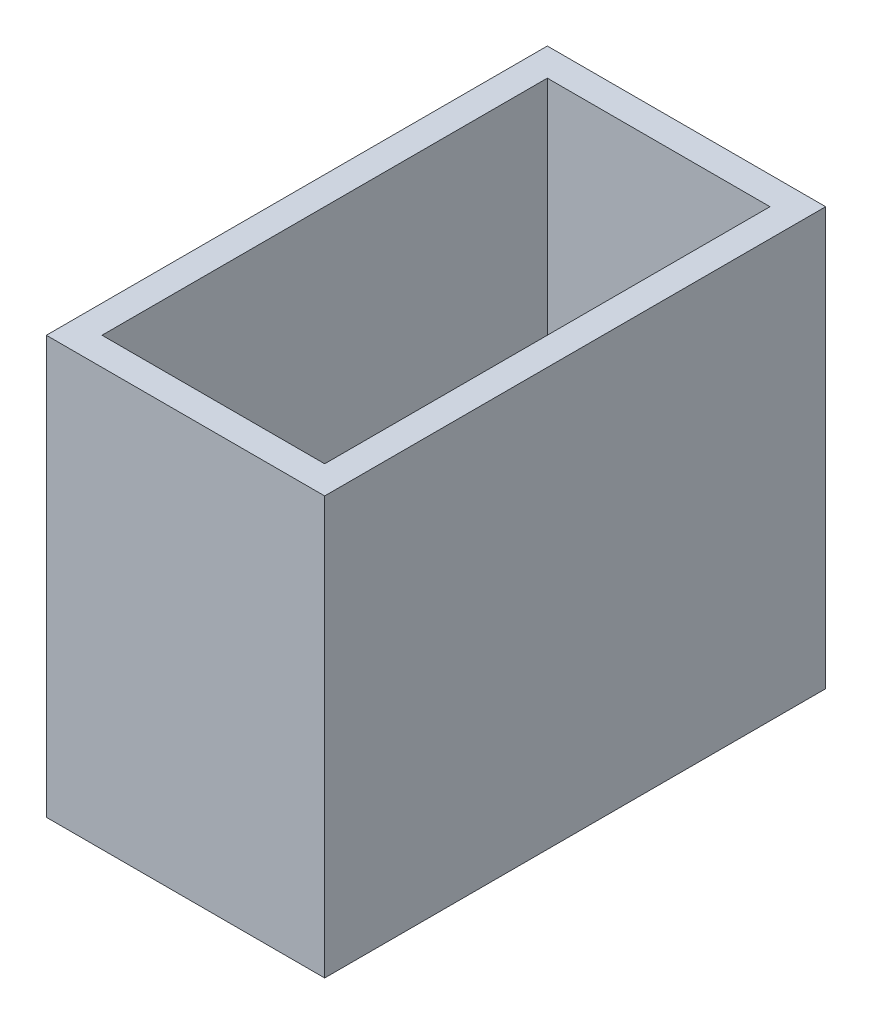
ISO-10303-21;
HEADER;
FILE_DESCRIPTION(('STEP AP214'),'2;1');
FILE_NAME('part.step','',(''),(''),'','','');
FILE_SCHEMA(('AUTOMOTIVE_DESIGN { 1 0 10303 214 1 1 1 1 }'));
ENDSEC;
DATA;
#1=APPLICATION_CONTEXT('core data for automotive mechanical design processes');
#2=APPLICATION_PROTOCOL_DEFINITION('international standard','automotive_design',2000,#1);
#3=PRODUCT_CONTEXT('',#1,'mechanical');
#4=PRODUCT('Part','Part','',(#3));
#5=PRODUCT_RELATED_PRODUCT_CATEGORY('part','',(#4));
#6=PRODUCT_DEFINITION_FORMATION('','',#4);
#7=PRODUCT_DEFINITION_CONTEXT('part definition',#1,'design');
#8=PRODUCT_DEFINITION('design','',#6,#7);
#9=PRODUCT_DEFINITION_SHAPE('','',#8);
#10=(LENGTH_UNIT() NAMED_UNIT(*) SI_UNIT(.MILLI.,.METRE.));
#11=(NAMED_UNIT(*) PLANE_ANGLE_UNIT() SI_UNIT($,.RADIAN.));
#12=(NAMED_UNIT(*) SI_UNIT($,.STERADIAN.) SOLID_ANGLE_UNIT());
#13=UNCERTAINTY_MEASURE_WITH_UNIT(LENGTH_MEASURE(1.E-05),#10,'distance_accuracy_value','');
#14=(GEOMETRIC_REPRESENTATION_CONTEXT(3) GLOBAL_UNCERTAINTY_ASSIGNED_CONTEXT((#13)) GLOBAL_UNIT_ASSIGNED_CONTEXT((#10,
#11,#12)) REPRESENTATION_CONTEXT('',''));
#15=CARTESIAN_POINT('',(0.,0.,0.));
#16=DIRECTION('',(0.,0.,1.));
#17=DIRECTION('',(1.,0.,0.));
#18=AXIS2_PLACEMENT_3D('',#15,#16,#17);
#19=CARTESIAN_POINT('',(0.,15.,0.));
#20=DIRECTION('',(0.,-1.,0.));
#21=DIRECTION('',(0.,0.,-1.));
#22=AXIS2_PLACEMENT_3D('',#19,#20,#21);
#23=PLANE('',#22);
#24=DIRECTION('',(0.,0.,-1.));
#25=VECTOR('',#24,1.);
#26=CARTESIAN_POINT('',(5.,15.,9.));
#27=LINE('',#26,#25);
#28=CARTESIAN_POINT('',(5.,15.,9.));
#29=VERTEX_POINT('',#28);
#30=CARTESIAN_POINT('',(5.,15.,-9.));
#31=VERTEX_POINT('',#30);
#32=EDGE_CURVE('E135',#29,#31,#27,.T.);
#33=ORIENTED_EDGE('',*,*,#32,.T.);
#34=DIRECTION('',(-1.,0.,0.));
#35=VECTOR('',#34,1.);
#36=CARTESIAN_POINT('',(-5.,15.,-9.));
#37=LINE('',#36,#35);
#38=CARTESIAN_POINT('',(-5.,15.,-9.));
#39=VERTEX_POINT('',#38);
#40=EDGE_CURVE('E138',#31,#39,#37,.T.);
#41=ORIENTED_EDGE('',*,*,#40,.T.);
#42=DIRECTION('',(0.,0.,1.));
#43=VECTOR('',#42,1.);
#44=CARTESIAN_POINT('',(-5.,15.,9.));
#45=LINE('',#44,#43);
#46=CARTESIAN_POINT('',(-5.,15.,9.));
#47=VERTEX_POINT('',#46);
#48=EDGE_CURVE('E141',#39,#47,#45,.T.);
#49=ORIENTED_EDGE('',*,*,#48,.T.);
#50=DIRECTION('',(1.,0.,0.));
#51=VECTOR('',#50,1.);
#52=CARTESIAN_POINT('',(-5.,15.,9.));
#53=LINE('',#52,#51);
#54=EDGE_CURVE('E143',#47,#29,#53,.T.);
#55=ORIENTED_EDGE('',*,*,#54,.T.);
#56=EDGE_LOOP('',(#33,#41,#49,#55));
#57=FACE_BOUND('',#56,.T.);
#58=DIRECTION('',(0.,0.,1.));
#59=VECTOR('',#58,1.);
#60=CARTESIAN_POINT('',(-4.,15.,8.));
#61=LINE('',#60,#59);
#62=CARTESIAN_POINT('',(-4.,15.,-8.));
#63=VERTEX_POINT('',#62);
#64=CARTESIAN_POINT('',(-4.,15.,8.));
#65=VERTEX_POINT('',#64);
#66=EDGE_CURVE('E99',#63,#65,#61,.T.);
#67=ORIENTED_EDGE('',*,*,#66,.F.);
#68=DIRECTION('',(-1.,0.,0.));
#69=VECTOR('',#68,1.);
#70=CARTESIAN_POINT('',(-4.,15.,-8.));
#71=LINE('',#70,#69);
#72=CARTESIAN_POINT('',(4.,15.,-8.));
#73=VERTEX_POINT('',#72);
#74=EDGE_CURVE('E121',#73,#63,#71,.T.);
#75=ORIENTED_EDGE('',*,*,#74,.F.);
#76=DIRECTION('',(0.,0.,-1.));
#77=VECTOR('',#76,1.);
#78=CARTESIAN_POINT('',(4.,15.,8.));
#79=LINE('',#78,#77);
#80=CARTESIAN_POINT('',(4.,15.,8.));
#81=VERTEX_POINT('',#80);
#82=EDGE_CURVE('E119',#81,#73,#79,.T.);
#83=ORIENTED_EDGE('',*,*,#82,.F.);
#84=DIRECTION('',(1.,0.,0.));
#85=VECTOR('',#84,1.);
#86=CARTESIAN_POINT('',(-4.,15.,8.));
#87=LINE('',#86,#85);
#88=EDGE_CURVE('E107',#65,#81,#87,.T.);
#89=ORIENTED_EDGE('',*,*,#88,.F.);
#90=EDGE_LOOP('',(#67,#75,#83,#89));
#91=FACE_BOUND('',#90,.T.);
#92=ADVANCED_FACE('F34',(#57,#91),#23,.F.);
#93=CARTESIAN_POINT('',(0.,0.,0.));
#94=DIRECTION('',(0.,-1.,0.));
#95=DIRECTION('',(0.,0.,-1.));
#96=AXIS2_PLACEMENT_3D('',#93,#94,#95);
#97=PLANE('',#96);
#98=DIRECTION('',(0.,0.,-1.));
#99=VECTOR('',#98,1.);
#100=CARTESIAN_POINT('',(5.,0.,9.));
#101=LINE('',#100,#99);
#102=CARTESIAN_POINT('',(5.,0.,9.));
#103=VERTEX_POINT('',#102);
#104=CARTESIAN_POINT('',(5.,0.,-9.));
#105=VERTEX_POINT('',#104);
#106=EDGE_CURVE('E115',#103,#105,#101,.T.);
#107=ORIENTED_EDGE('',*,*,#106,.F.);
#108=DIRECTION('',(1.,0.,0.));
#109=VECTOR('',#108,1.);
#110=CARTESIAN_POINT('',(-5.,0.,9.));
#111=LINE('',#110,#109);
#112=CARTESIAN_POINT('',(-5.,0.,9.));
#113=VERTEX_POINT('',#112);
#114=EDGE_CURVE('E139',#113,#103,#111,.T.);
#115=ORIENTED_EDGE('',*,*,#114,.F.);
#116=DIRECTION('',(0.,0.,1.));
#117=VECTOR('',#116,1.);
#118=CARTESIAN_POINT('',(-5.,0.,9.));
#119=LINE('',#118,#117);
#120=CARTESIAN_POINT('',(-5.,0.,-9.));
#121=VERTEX_POINT('',#120);
#122=EDGE_CURVE('E150',#121,#113,#119,.T.);
#123=ORIENTED_EDGE('',*,*,#122,.F.);
#124=DIRECTION('',(-1.,0.,0.));
#125=VECTOR('',#124,1.);
#126=CARTESIAN_POINT('',(-5.,0.,-9.));
#127=LINE('',#126,#125);
#128=EDGE_CURVE('E148',#105,#121,#127,.T.);
#129=ORIENTED_EDGE('',*,*,#128,.F.);
#130=EDGE_LOOP('',(#107,#115,#123,#129));
#131=FACE_BOUND('',#130,.T.);
#132=DIRECTION('',(-1.,0.,0.));
#133=VECTOR('',#132,1.);
#134=CARTESIAN_POINT('',(-4.,0.,-8.));
#135=LINE('',#134,#133);
#136=CARTESIAN_POINT('',(4.,0.,-8.));
#137=VERTEX_POINT('',#136);
#138=CARTESIAN_POINT('',(-4.,0.,-8.));
#139=VERTEX_POINT('',#138);
#140=EDGE_CURVE('E108',#137,#139,#135,.T.);
#141=ORIENTED_EDGE('',*,*,#140,.T.);
#142=DIRECTION('',(0.,0.,1.));
#143=VECTOR('',#142,1.);
#144=CARTESIAN_POINT('',(-4.,0.,8.));
#145=LINE('',#144,#143);
#146=CARTESIAN_POINT('',(-4.,0.,8.));
#147=VERTEX_POINT('',#146);
#148=EDGE_CURVE('E57',#139,#147,#145,.T.);
#149=ORIENTED_EDGE('',*,*,#148,.T.);
#150=DIRECTION('',(1.,0.,0.));
#151=VECTOR('',#150,1.);
#152=CARTESIAN_POINT('',(-4.,0.,8.));
#153=LINE('',#152,#151);
#154=CARTESIAN_POINT('',(4.,0.,8.));
#155=VERTEX_POINT('',#154);
#156=EDGE_CURVE('E114',#147,#155,#153,.T.);
#157=ORIENTED_EDGE('',*,*,#156,.T.);
#158=DIRECTION('',(0.,0.,-1.));
#159=VECTOR('',#158,1.);
#160=CARTESIAN_POINT('',(4.,0.,8.));
#161=LINE('',#160,#159);
#162=EDGE_CURVE('E127',#155,#137,#161,.T.);
#163=ORIENTED_EDGE('',*,*,#162,.T.);
#164=EDGE_LOOP('',(#141,#149,#157,#163));
#165=FACE_BOUND('',#164,.T.);
#166=ADVANCED_FACE('F168',(#131,#165),#97,.T.);
#167=CARTESIAN_POINT('',(5.,15.,9.));
#168=DIRECTION('',(-1.,0.,0.));
#169=DIRECTION('',(0.,0.,1.));
#170=AXIS2_PLACEMENT_3D('',#167,#168,#169);
#171=PLANE('',#170);
#172=ORIENTED_EDGE('',*,*,#106,.T.);
#173=DIRECTION('',(0.,-1.,0.));
#174=VECTOR('',#173,1.);
#175=CARTESIAN_POINT('',(5.,15.,-9.));
#176=LINE('',#175,#174);
#177=EDGE_CURVE('E11',#31,#105,#176,.T.);
#178=ORIENTED_EDGE('',*,*,#177,.F.);
#179=ORIENTED_EDGE('',*,*,#32,.F.);
#180=DIRECTION('',(0.,-1.,0.));
#181=VECTOR('',#180,1.);
#182=CARTESIAN_POINT('',(5.,15.,9.));
#183=LINE('',#182,#181);
#184=EDGE_CURVE('E145',#29,#103,#183,.T.);
#185=ORIENTED_EDGE('',*,*,#184,.T.);
#186=EDGE_LOOP('',(#172,#178,#179,#185));
#187=FACE_BOUND('',#186,.T.);
#188=ADVANCED_FACE('F36',(#187),#171,.F.);
#189=CARTESIAN_POINT('',(-5.,15.,-9.));
#190=DIRECTION('',(0.,0.,1.));
#191=DIRECTION('',(1.,0.,0.));
#192=AXIS2_PLACEMENT_3D('',#189,#190,#191);
#193=PLANE('',#192);
#194=ORIENTED_EDGE('',*,*,#128,.T.);
#195=DIRECTION('',(0.,-1.,0.));
#196=VECTOR('',#195,1.);
#197=CARTESIAN_POINT('',(-5.,15.,-9.));
#198=LINE('',#197,#196);
#199=EDGE_CURVE('E42',#39,#121,#198,.T.);
#200=ORIENTED_EDGE('',*,*,#199,.F.);
#201=ORIENTED_EDGE('',*,*,#40,.F.);
#202=ORIENTED_EDGE('',*,*,#177,.T.);
#203=EDGE_LOOP('',(#194,#200,#201,#202));
#204=FACE_BOUND('',#203,.T.);
#205=ADVANCED_FACE('F178',(#204),#193,.F.);
#206=CARTESIAN_POINT('',(-5.,15.,9.));
#207=DIRECTION('',(1.,0.,0.));
#208=DIRECTION('',(0.,0.,-1.));
#209=AXIS2_PLACEMENT_3D('',#206,#207,#208);
#210=PLANE('',#209);
#211=ORIENTED_EDGE('',*,*,#122,.T.);
#212=DIRECTION('',(0.,-1.,0.));
#213=VECTOR('',#212,1.);
#214=CARTESIAN_POINT('',(-5.,15.,9.));
#215=LINE('',#214,#213);
#216=EDGE_CURVE('E155',#47,#113,#215,.T.);
#217=ORIENTED_EDGE('',*,*,#216,.F.);
#218=ORIENTED_EDGE('',*,*,#48,.F.);
#219=ORIENTED_EDGE('',*,*,#199,.T.);
#220=EDGE_LOOP('',(#211,#217,#218,#219));
#221=FACE_BOUND('',#220,.T.);
#222=ADVANCED_FACE('F162',(#221),#210,.F.);
#223=CARTESIAN_POINT('',(-5.,15.,9.));
#224=DIRECTION('',(0.,0.,-1.));
#225=DIRECTION('',(-1.,0.,0.));
#226=AXIS2_PLACEMENT_3D('',#223,#224,#225);
#227=PLANE('',#226);
#228=ORIENTED_EDGE('',*,*,#114,.T.);
#229=ORIENTED_EDGE('',*,*,#184,.F.);
#230=ORIENTED_EDGE('',*,*,#54,.F.);
#231=ORIENTED_EDGE('',*,*,#216,.T.);
#232=EDGE_LOOP('',(#228,#229,#230,#231));
#233=FACE_BOUND('',#232,.T.);
#234=ADVANCED_FACE('F172',(#233),#227,.F.);
#235=CARTESIAN_POINT('',(-4.,15.,8.));
#236=DIRECTION('',(1.,0.,0.));
#237=DIRECTION('',(0.,0.,-1.));
#238=AXIS2_PLACEMENT_3D('',#235,#236,#237);
#239=PLANE('',#238);
#240=ORIENTED_EDGE('',*,*,#148,.F.);
#241=DIRECTION('',(0.,-1.,0.));
#242=VECTOR('',#241,1.);
#243=CARTESIAN_POINT('',(-4.,15.,-8.));
#244=LINE('',#243,#242);
#245=EDGE_CURVE('E103',#63,#139,#244,.T.);
#246=ORIENTED_EDGE('',*,*,#245,.F.);
#247=ORIENTED_EDGE('',*,*,#66,.T.);
#248=DIRECTION('',(0.,-1.,0.));
#249=VECTOR('',#248,1.);
#250=CARTESIAN_POINT('',(-4.,15.,8.));
#251=LINE('',#250,#249);
#252=EDGE_CURVE('E102',#65,#147,#251,.T.);
#253=ORIENTED_EDGE('',*,*,#252,.T.);
#254=EDGE_LOOP('',(#240,#246,#247,#253));
#255=FACE_BOUND('',#254,.T.);
#256=ADVANCED_FACE('F101',(#255),#239,.T.);
#257=CARTESIAN_POINT('',(-4.,15.,8.));
#258=DIRECTION('',(0.,0.,-1.));
#259=DIRECTION('',(-1.,0.,0.));
#260=AXIS2_PLACEMENT_3D('',#257,#258,#259);
#261=PLANE('',#260);
#262=ORIENTED_EDGE('',*,*,#156,.F.);
#263=ORIENTED_EDGE('',*,*,#252,.F.);
#264=ORIENTED_EDGE('',*,*,#88,.T.);
#265=DIRECTION('',(0.,-1.,0.));
#266=VECTOR('',#265,1.);
#267=CARTESIAN_POINT('',(4.,15.,8.));
#268=LINE('',#267,#266);
#269=EDGE_CURVE('E116',#81,#155,#268,.T.);
#270=ORIENTED_EDGE('',*,*,#269,.T.);
#271=EDGE_LOOP('',(#262,#263,#264,#270));
#272=FACE_BOUND('',#271,.T.);
#273=ADVANCED_FACE('F111',(#272),#261,.T.);
#274=CARTESIAN_POINT('',(4.,15.,8.));
#275=DIRECTION('',(-1.,0.,0.));
#276=DIRECTION('',(0.,0.,1.));
#277=AXIS2_PLACEMENT_3D('',#274,#275,#276);
#278=PLANE('',#277);
#279=ORIENTED_EDGE('',*,*,#162,.F.);
#280=ORIENTED_EDGE('',*,*,#269,.F.);
#281=ORIENTED_EDGE('',*,*,#82,.T.);
#282=DIRECTION('',(0.,-1.,0.));
#283=VECTOR('',#282,1.);
#284=CARTESIAN_POINT('',(4.,15.,-8.));
#285=LINE('',#284,#283);
#286=EDGE_CURVE('E49',#73,#137,#285,.T.);
#287=ORIENTED_EDGE('',*,*,#286,.T.);
#288=EDGE_LOOP('',(#279,#280,#281,#287));
#289=FACE_BOUND('',#288,.T.);
#290=ADVANCED_FACE('F201',(#289),#278,.T.);
#291=CARTESIAN_POINT('',(-4.,15.,-8.));
#292=DIRECTION('',(0.,0.,1.));
#293=DIRECTION('',(1.,0.,0.));
#294=AXIS2_PLACEMENT_3D('',#291,#292,#293);
#295=PLANE('',#294);
#296=ORIENTED_EDGE('',*,*,#140,.F.);
#297=ORIENTED_EDGE('',*,*,#286,.F.);
#298=ORIENTED_EDGE('',*,*,#74,.T.);
#299=ORIENTED_EDGE('',*,*,#245,.T.);
#300=EDGE_LOOP('',(#296,#297,#298,#299));
#301=FACE_BOUND('',#300,.T.);
#302=ADVANCED_FACE('F205',(#301),#295,.T.);
#303=CLOSED_SHELL('',(#92,#166,#188,#205,#222,#234,#256,#273,#290,#302));
#304=MANIFOLD_SOLID_BREP('B2',#303);
#305=ADVANCED_BREP_SHAPE_REPRESENTATION('',(#18,#304),#14);
#306=SHAPE_DEFINITION_REPRESENTATION(#9,#305);
ENDSEC;
END-ISO-10303-21;
